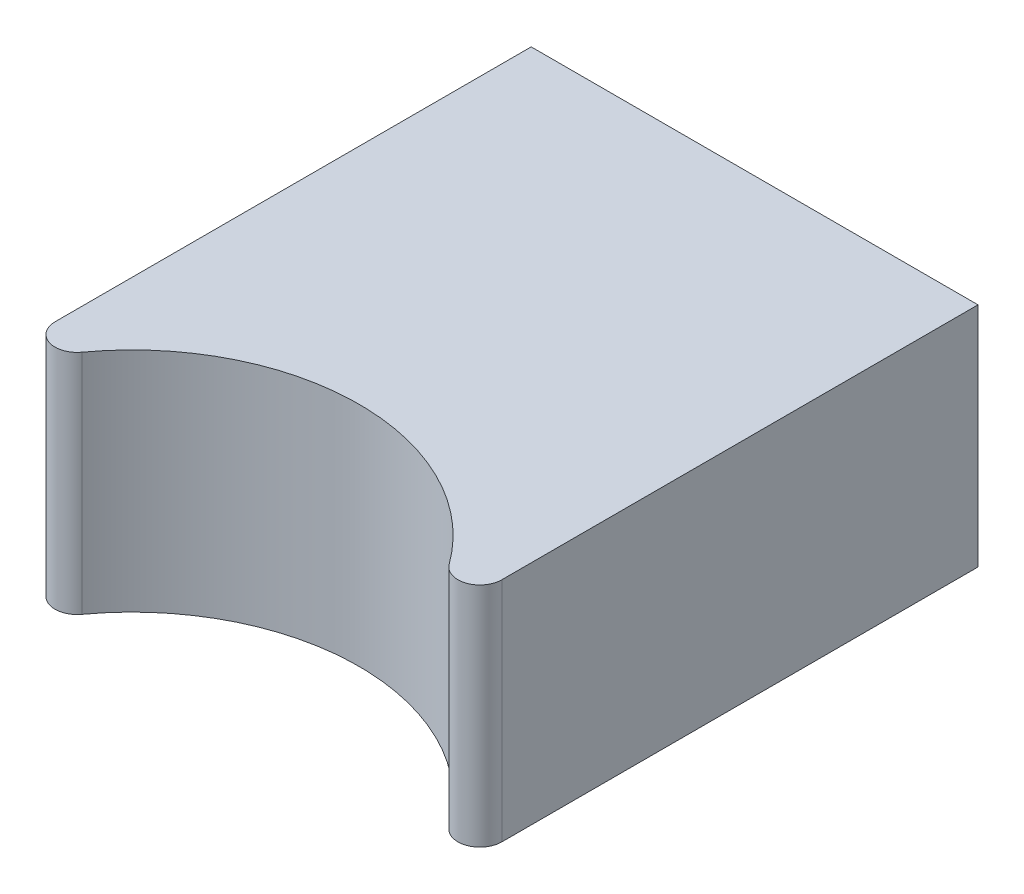
ISO-10303-21;
HEADER;
FILE_DESCRIPTION(('STEP AP214'),'2;1');
FILE_NAME('part.step','',(''),(''),'','','');
FILE_SCHEMA(('AUTOMOTIVE_DESIGN { 1 0 10303 214 1 1 1 1 }'));
ENDSEC;
DATA;
#1=APPLICATION_CONTEXT('core data for automotive mechanical design processes');
#2=APPLICATION_PROTOCOL_DEFINITION('international standard','automotive_design',2000,#1);
#3=PRODUCT_CONTEXT('',#1,'mechanical');
#4=PRODUCT('Part','Part','',(#3));
#5=PRODUCT_RELATED_PRODUCT_CATEGORY('part','',(#4));
#6=PRODUCT_DEFINITION_FORMATION('','',#4);
#7=PRODUCT_DEFINITION_CONTEXT('part definition',#1,'design');
#8=PRODUCT_DEFINITION('design','',#6,#7);
#9=PRODUCT_DEFINITION_SHAPE('','',#8);
#10=(LENGTH_UNIT() NAMED_UNIT(*) SI_UNIT(.MILLI.,.METRE.));
#11=(NAMED_UNIT(*) PLANE_ANGLE_UNIT() SI_UNIT($,.RADIAN.));
#12=(NAMED_UNIT(*) SI_UNIT($,.STERADIAN.) SOLID_ANGLE_UNIT());
#13=UNCERTAINTY_MEASURE_WITH_UNIT(LENGTH_MEASURE(1.E-05),#10,'distance_accuracy_value','');
#14=(GEOMETRIC_REPRESENTATION_CONTEXT(3) GLOBAL_UNCERTAINTY_ASSIGNED_CONTEXT((#13)) GLOBAL_UNIT_ASSIGNED_CONTEXT((#10,
#11,#12)) REPRESENTATION_CONTEXT('',''));
#15=CARTESIAN_POINT('',(0.,0.,0.));
#16=DIRECTION('',(0.,0.,1.));
#17=DIRECTION('',(1.,0.,0.));
#18=AXIS2_PLACEMENT_3D('',#15,#16,#17);
#19=CARTESIAN_POINT('',(-3.05,3.1,0.));
#20=DIRECTION('',(-1.,0.,0.));
#21=DIRECTION('',(0.,0.,1.));
#22=AXIS2_PLACEMENT_3D('',#19,#20,#21);
#23=PLANE('',#22);
#24=DIRECTION('',(0.,0.,-1.));
#25=VECTOR('',#24,1.);
#26=CARTESIAN_POINT('',(-3.05,0.,0.));
#27=LINE('',#26,#25);
#28=CARTESIAN_POINT('',(-3.05,0.,3.80062509768678));
#29=VERTEX_POINT('',#28);
#30=CARTESIAN_POINT('',(-3.05,0.,-2.7));
#31=VERTEX_POINT('',#30);
#32=EDGE_CURVE('E114',#29,#31,#27,.T.);
#33=ORIENTED_EDGE('',*,*,#32,.F.);
#34=DIRECTION('',(0.,-1.,0.));
#35=VECTOR('',#34,1.);
#36=CARTESIAN_POINT('',(-3.05,3.1,3.80062509768678));
#37=LINE('',#36,#35);
#38=CARTESIAN_POINT('',(-3.05,3.1,3.80062509768678));
#39=VERTEX_POINT('',#38);
#40=EDGE_CURVE('E11',#29,#39,#37,.F.);
#41=ORIENTED_EDGE('',*,*,#40,.T.);
#42=DIRECTION('',(0.,0.,-1.));
#43=VECTOR('',#42,1.);
#44=CARTESIAN_POINT('',(-3.05,3.1,0.));
#45=LINE('',#44,#43);
#46=CARTESIAN_POINT('',(-3.05,3.1,-2.7));
#47=VERTEX_POINT('',#46);
#48=EDGE_CURVE('E121',#39,#47,#45,.T.);
#49=ORIENTED_EDGE('',*,*,#48,.T.);
#50=DIRECTION('',(0.,-1.,0.));
#51=VECTOR('',#50,1.);
#52=CARTESIAN_POINT('',(-3.05,3.1,-2.7));
#53=LINE('',#52,#51);
#54=EDGE_CURVE('E105',#47,#31,#53,.T.);
#55=ORIENTED_EDGE('',*,*,#54,.T.);
#56=EDGE_LOOP('',(#33,#41,#49,#55));
#57=FACE_BOUND('',#56,.T.);
#58=ADVANCED_FACE('F33',(#57),#23,.T.);
#59=CARTESIAN_POINT('',(0.,3.1,5.8));
#60=DIRECTION('',(0.,-1.,0.));
#61=DIRECTION('',(0.,0.,-1.));
#62=AXIS2_PLACEMENT_3D('',#59,#60,#61);
#63=CYLINDRICAL_SURFACE('',#62,3.1);
#64=CARTESIAN_POINT('',(0.,0.,5.8));
#65=DIRECTION('',(0.,1.,0.));
#66=DIRECTION('',(0.,0.,1.));
#67=AXIS2_PLACEMENT_3D('',#64,#65,#66);
#68=CIRCLE('',#67,3.1);
#69=CARTESIAN_POINT('',(2.50735294117647,0.,3.97704053024383));
#70=VERTEX_POINT('',#69);
#71=CARTESIAN_POINT('',(-2.50735294117647,0.,3.97704053024383));
#72=VERTEX_POINT('',#71);
#73=EDGE_CURVE('E116',#70,#72,#68,.T.);
#74=ORIENTED_EDGE('',*,*,#73,.F.);
#75=DIRECTION('',(0.,-1.,0.));
#76=VECTOR('',#75,1.);
#77=CARTESIAN_POINT('',(2.50735294117647,3.1,3.97704053024383));
#78=LINE('',#77,#76);
#79=CARTESIAN_POINT('',(2.50735294117647,3.1,3.97704053024383));
#80=VERTEX_POINT('',#79);
#81=EDGE_CURVE('E131',#70,#80,#78,.F.);
#82=ORIENTED_EDGE('',*,*,#81,.T.);
#83=CARTESIAN_POINT('',(0.,3.1,5.8));
#84=DIRECTION('',(0.,1.,0.));
#85=DIRECTION('',(0.,0.,1.));
#86=AXIS2_PLACEMENT_3D('',#83,#84,#85);
#87=CIRCLE('',#86,3.1);
#88=CARTESIAN_POINT('',(-2.50735294117647,3.1,3.97704053024383));
#89=VERTEX_POINT('',#88);
#90=EDGE_CURVE('E94',#80,#89,#87,.T.);
#91=ORIENTED_EDGE('',*,*,#90,.T.);
#92=DIRECTION('',(0.,-1.,0.));
#93=VECTOR('',#92,1.);
#94=CARTESIAN_POINT('',(-2.50735294117647,3.1,3.97704053024383));
#95=LINE('',#94,#93);
#96=EDGE_CURVE('E128',#89,#72,#95,.T.);
#97=ORIENTED_EDGE('',*,*,#96,.T.);
#98=EDGE_LOOP('',(#74,#82,#91,#97));
#99=FACE_BOUND('',#98,.T.);
#100=ADVANCED_FACE('F136',(#99),#63,.F.);
#101=CARTESIAN_POINT('',(3.05,3.1,0.));
#102=DIRECTION('',(-1.,0.,0.));
#103=DIRECTION('',(0.,0.,1.));
#104=AXIS2_PLACEMENT_3D('',#101,#102,#103);
#105=PLANE('',#104);
#106=DIRECTION('',(0.,0.,-1.));
#107=VECTOR('',#106,1.);
#108=CARTESIAN_POINT('',(3.05,3.1,0.));
#109=LINE('',#108,#107);
#110=CARTESIAN_POINT('',(3.05,3.1,3.80062509768678));
#111=VERTEX_POINT('',#110);
#112=CARTESIAN_POINT('',(3.05,3.1,-2.7));
#113=VERTEX_POINT('',#112);
#114=EDGE_CURVE('E85',#111,#113,#109,.T.);
#115=ORIENTED_EDGE('',*,*,#114,.F.);
#116=DIRECTION('',(0.,1.,0.));
#117=VECTOR('',#116,1.);
#118=CARTESIAN_POINT('',(3.05,0.,3.80062509768678));
#119=LINE('',#118,#117);
#120=CARTESIAN_POINT('',(3.05,0.,3.80062509768678));
#121=VERTEX_POINT('',#120);
#122=EDGE_CURVE('E104',#111,#121,#119,.F.);
#123=ORIENTED_EDGE('',*,*,#122,.T.);
#124=DIRECTION('',(0.,0.,-1.));
#125=VECTOR('',#124,1.);
#126=CARTESIAN_POINT('',(3.05,0.,0.));
#127=LINE('',#126,#125);
#128=CARTESIAN_POINT('',(3.05,0.,-2.7));
#129=VERTEX_POINT('',#128);
#130=EDGE_CURVE('E100',#121,#129,#127,.T.);
#131=ORIENTED_EDGE('',*,*,#130,.T.);
#132=DIRECTION('',(0.,-1.,0.));
#133=VECTOR('',#132,1.);
#134=CARTESIAN_POINT('',(3.05,3.1,-2.7));
#135=LINE('',#134,#133);
#136=EDGE_CURVE('E97',#113,#129,#135,.T.);
#137=ORIENTED_EDGE('',*,*,#136,.F.);
#138=EDGE_LOOP('',(#115,#123,#131,#137));
#139=FACE_BOUND('',#138,.T.);
#140=ADVANCED_FACE('F98',(#139),#105,.F.);
#141=CARTESIAN_POINT('',(0.,3.1,-2.7));
#142=DIRECTION('',(0.,0.,-1.));
#143=DIRECTION('',(-1.,0.,0.));
#144=AXIS2_PLACEMENT_3D('',#141,#142,#143);
#145=PLANE('',#144);
#146=DIRECTION('',(1.,0.,0.));
#147=VECTOR('',#146,1.);
#148=CARTESIAN_POINT('',(0.,0.,-2.7));
#149=LINE('',#148,#147);
#150=EDGE_CURVE('E120',#31,#129,#149,.T.);
#151=ORIENTED_EDGE('',*,*,#150,.F.);
#152=ORIENTED_EDGE('',*,*,#54,.F.);
#153=DIRECTION('',(1.,0.,0.));
#154=VECTOR('',#153,1.);
#155=CARTESIAN_POINT('',(0.,3.1,-2.7));
#156=LINE('',#155,#154);
#157=EDGE_CURVE('E89',#47,#113,#156,.T.);
#158=ORIENTED_EDGE('',*,*,#157,.T.);
#159=ORIENTED_EDGE('',*,*,#136,.T.);
#160=EDGE_LOOP('',(#151,#152,#158,#159));
#161=FACE_BOUND('',#160,.T.);
#162=ADVANCED_FACE('F108',(#161),#145,.T.);
#163=CARTESIAN_POINT('',(0.,3.1,0.));
#164=DIRECTION('',(0.,1.,0.));
#165=DIRECTION('',(0.,0.,1.));
#166=AXIS2_PLACEMENT_3D('',#163,#164,#165);
#167=PLANE('',#166);
#168=ORIENTED_EDGE('',*,*,#90,.F.);
#169=CARTESIAN_POINT('',(2.75,3.1,3.80062509768678));
#170=DIRECTION('',(0.,1.,0.));
#171=DIRECTION('',(0.,0.,1.));
#172=AXIS2_PLACEMENT_3D('',#169,#170,#171);
#173=CIRCLE('',#172,0.3);
#174=EDGE_CURVE('E41',#80,#111,#173,.T.);
#175=ORIENTED_EDGE('',*,*,#174,.T.);
#176=ORIENTED_EDGE('',*,*,#114,.T.);
#177=ORIENTED_EDGE('',*,*,#157,.F.);
#178=ORIENTED_EDGE('',*,*,#48,.F.);
#179=CARTESIAN_POINT('',(-2.75,3.1,3.80062509768678));
#180=DIRECTION('',(0.,1.,0.));
#181=DIRECTION('',(0.,0.,1.));
#182=AXIS2_PLACEMENT_3D('',#179,#180,#181);
#183=CIRCLE('',#182,0.3);
#184=EDGE_CURVE('E53',#39,#89,#183,.T.);
#185=ORIENTED_EDGE('',*,*,#184,.T.);
#186=EDGE_LOOP('',(#168,#175,#176,#177,#178,#185));
#187=FACE_BOUND('',#186,.T.);
#188=ADVANCED_FACE('F87',(#187),#167,.T.);
#189=CARTESIAN_POINT('',(0.,0.,0.));
#190=DIRECTION('',(0.,1.,0.));
#191=DIRECTION('',(0.,0.,1.));
#192=AXIS2_PLACEMENT_3D('',#189,#190,#191);
#193=PLANE('',#192);
#194=ORIENTED_EDGE('',*,*,#130,.F.);
#195=CARTESIAN_POINT('',(2.75,0.,3.80062509768678));
#196=DIRECTION('',(0.,1.,0.));
#197=DIRECTION('',(0.,0.,1.));
#198=AXIS2_PLACEMENT_3D('',#195,#196,#197);
#199=CIRCLE('',#198,0.3);
#200=EDGE_CURVE('E126',#121,#70,#199,.F.);
#201=ORIENTED_EDGE('',*,*,#200,.T.);
#202=ORIENTED_EDGE('',*,*,#73,.T.);
#203=CARTESIAN_POINT('',(-2.75,0.,3.80062509768678));
#204=DIRECTION('',(0.,1.,0.));
#205=DIRECTION('',(0.,0.,1.));
#206=AXIS2_PLACEMENT_3D('',#203,#204,#205);
#207=CIRCLE('',#206,0.3);
#208=EDGE_CURVE('E124',#72,#29,#207,.F.);
#209=ORIENTED_EDGE('',*,*,#208,.T.);
#210=ORIENTED_EDGE('',*,*,#32,.T.);
#211=ORIENTED_EDGE('',*,*,#150,.T.);
#212=EDGE_LOOP('',(#194,#201,#202,#209,#210,#211));
#213=FACE_BOUND('',#212,.T.);
#214=ADVANCED_FACE('F141',(#213),#193,.F.);
#215=CARTESIAN_POINT('',(2.75,3.1,3.80062509768678));
#216=DIRECTION('',(0.,-1.,0.));
#217=DIRECTION('',(0.,0.,-1.));
#218=AXIS2_PLACEMENT_3D('',#215,#216,#217);
#219=CYLINDRICAL_SURFACE('',#218,0.3);
#220=ORIENTED_EDGE('',*,*,#174,.F.);
#221=ORIENTED_EDGE('',*,*,#81,.F.);
#222=ORIENTED_EDGE('',*,*,#200,.F.);
#223=ORIENTED_EDGE('',*,*,#122,.F.);
#224=EDGE_LOOP('',(#220,#221,#222,#223));
#225=FACE_BOUND('',#224,.T.);
#226=ADVANCED_FACE('F139',(#225),#219,.T.);
#227=CARTESIAN_POINT('',(-2.75,3.1,3.80062509768678));
#228=DIRECTION('',(0.,-1.,0.));
#229=DIRECTION('',(0.,0.,-1.));
#230=AXIS2_PLACEMENT_3D('',#227,#228,#229);
#231=CYLINDRICAL_SURFACE('',#230,0.3);
#232=ORIENTED_EDGE('',*,*,#184,.F.);
#233=ORIENTED_EDGE('',*,*,#40,.F.);
#234=ORIENTED_EDGE('',*,*,#208,.F.);
#235=ORIENTED_EDGE('',*,*,#96,.F.);
#236=EDGE_LOOP('',(#232,#233,#234,#235));
#237=FACE_BOUND('',#236,.T.);
#238=ADVANCED_FACE('F35',(#237),#231,.T.);
#239=CLOSED_SHELL('',(#58,#100,#140,#162,#188,#214,#226,#238));
#240=MANIFOLD_SOLID_BREP('B2',#239);
#241=ADVANCED_BREP_SHAPE_REPRESENTATION('',(#18,#240),#14);
#242=SHAPE_DEFINITION_REPRESENTATION(#9,#241);
ENDSEC;
END-ISO-10303-21;
